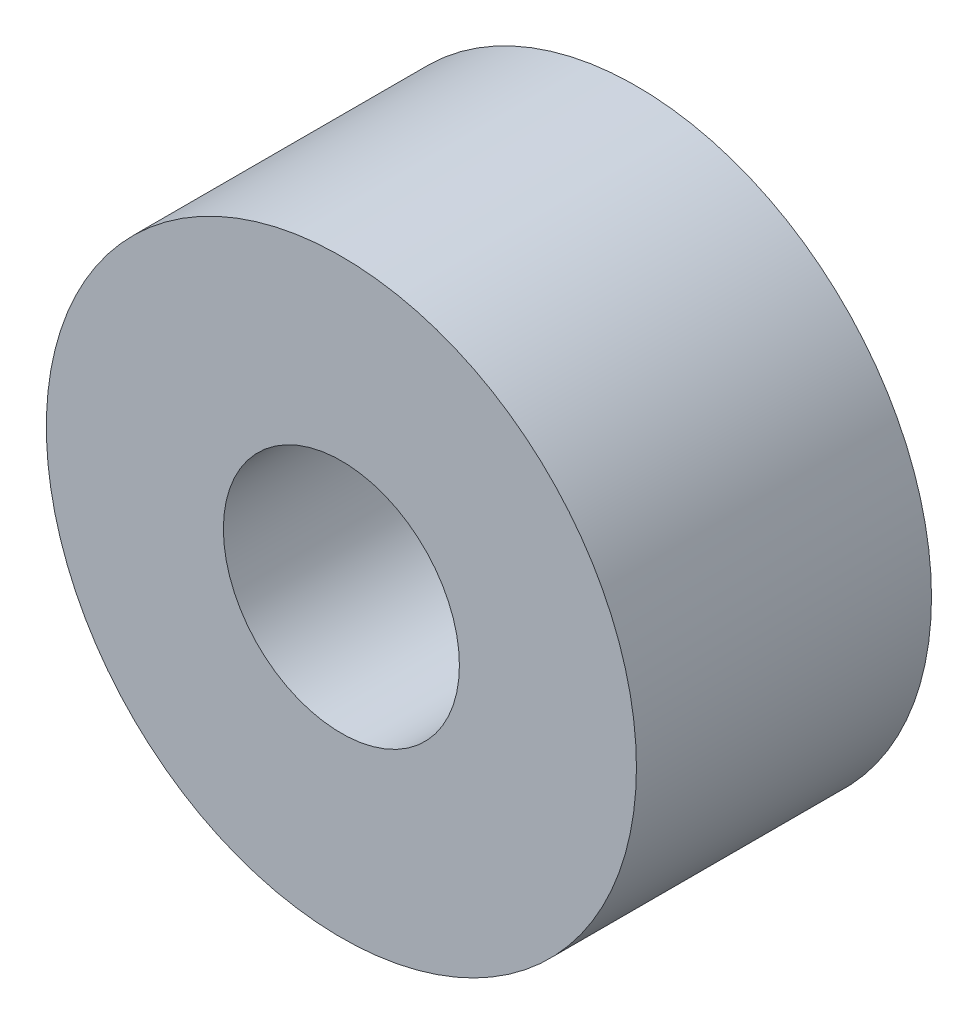
ISO-10303-21;
HEADER;
FILE_DESCRIPTION(('STEP AP214'),'2;1');
FILE_NAME('part.step','',(''),(''),'','','');
FILE_SCHEMA(('AUTOMOTIVE_DESIGN { 1 0 10303 214 1 1 1 1 }'));
ENDSEC;
DATA;
#1=APPLICATION_CONTEXT('core data for automotive mechanical design processes');
#2=APPLICATION_PROTOCOL_DEFINITION('international standard','automotive_design',2000,#1);
#3=PRODUCT_CONTEXT('',#1,'mechanical');
#4=PRODUCT('Part','Part','',(#3));
#5=PRODUCT_RELATED_PRODUCT_CATEGORY('part','',(#4));
#6=PRODUCT_DEFINITION_FORMATION('','',#4);
#7=PRODUCT_DEFINITION_CONTEXT('part definition',#1,'design');
#8=PRODUCT_DEFINITION('design','',#6,#7);
#9=PRODUCT_DEFINITION_SHAPE('','',#8);
#10=(LENGTH_UNIT() NAMED_UNIT(*) SI_UNIT(.MILLI.,.METRE.));
#11=(NAMED_UNIT(*) PLANE_ANGLE_UNIT() SI_UNIT($,.RADIAN.));
#12=(NAMED_UNIT(*) SI_UNIT($,.STERADIAN.) SOLID_ANGLE_UNIT());
#13=UNCERTAINTY_MEASURE_WITH_UNIT(LENGTH_MEASURE(1.E-05),#10,'distance_accuracy_value','');
#14=(GEOMETRIC_REPRESENTATION_CONTEXT(3) GLOBAL_UNCERTAINTY_ASSIGNED_CONTEXT((#13)) GLOBAL_UNIT_ASSIGNED_CONTEXT((#10,
#11,#12)) REPRESENTATION_CONTEXT('',''));
#15=CARTESIAN_POINT('',(0.,0.,0.));
#16=DIRECTION('',(0.,0.,1.));
#17=DIRECTION('',(1.,0.,0.));
#18=AXIS2_PLACEMENT_3D('',#15,#16,#17);
#19=CARTESIAN_POINT('',(35.9599999999989,18.866878763506,2.5));
#20=DIRECTION('',(0.,0.,-1.));
#21=DIRECTION('',(-1.,0.,0.));
#22=AXIS2_PLACEMENT_3D('',#19,#20,#21);
#23=CYLINDRICAL_SURFACE('',#22,2.5);
#24=CARTESIAN_POINT('',(35.9599999999989,18.866878763506,2.5));
#25=DIRECTION('',(0.,0.,1.));
#26=DIRECTION('',(1.,0.,0.));
#27=AXIS2_PLACEMENT_3D('',#24,#25,#26);
#28=CIRCLE('',#27,2.5);
#29=CARTESIAN_POINT('',(38.4599999999989,18.866878763506,2.5));
#30=VERTEX_POINT('',#29);
#31=EDGE_CURVE('E10',#30,#30,#28,.T.);
#32=ORIENTED_EDGE('',*,*,#31,.F.);
#33=EDGE_LOOP('',(#32));
#34=FACE_BOUND('',#33,.T.);
#35=CARTESIAN_POINT('',(35.9599999999989,18.866878763506,0.));
#36=DIRECTION('',(0.,0.,1.));
#37=DIRECTION('',(1.,0.,0.));
#38=AXIS2_PLACEMENT_3D('',#35,#36,#37);
#39=CIRCLE('',#38,2.5);
#40=CARTESIAN_POINT('',(38.4599999999989,18.866878763506,0.));
#41=VERTEX_POINT('',#40);
#42=EDGE_CURVE('E37',#41,#41,#39,.T.);
#43=ORIENTED_EDGE('',*,*,#42,.T.);
#44=EDGE_LOOP('',(#43));
#45=FACE_BOUND('',#44,.T.);
#46=ADVANCED_FACE('F30',(#34,#45),#23,.T.);
#47=CARTESIAN_POINT('',(35.9599999999989,18.866878763506,2.5));
#48=DIRECTION('',(0.,0.,1.));
#49=DIRECTION('',(1.,0.,0.));
#50=AXIS2_PLACEMENT_3D('',#47,#48,#49);
#51=PLANE('',#50);
#52=CARTESIAN_POINT('',(35.9599999999989,18.866878763506,2.5));
#53=DIRECTION('',(0.,0.,1.));
#54=DIRECTION('',(1.,0.,0.));
#55=AXIS2_PLACEMENT_3D('',#52,#53,#54);
#56=CIRCLE('',#55,0.999999999999998);
#57=CARTESIAN_POINT('',(36.9599999999989,18.866878763506,2.5));
#58=VERTEX_POINT('',#57);
#59=EDGE_CURVE('E43',#58,#58,#56,.T.);
#60=ORIENTED_EDGE('',*,*,#59,.F.);
#61=EDGE_LOOP('',(#60));
#62=FACE_BOUND('',#61,.T.);
#63=ORIENTED_EDGE('',*,*,#31,.T.);
#64=EDGE_LOOP('',(#63));
#65=FACE_BOUND('',#64,.T.);
#66=ADVANCED_FACE('F59',(#62,#65),#51,.T.);
#67=CARTESIAN_POINT('',(35.9599999999989,18.866878763506,0.));
#68=DIRECTION('',(0.,0.,1.));
#69=DIRECTION('',(1.,0.,0.));
#70=AXIS2_PLACEMENT_3D('',#67,#68,#69);
#71=PLANE('',#70);
#72=CARTESIAN_POINT('',(35.9599999999989,18.866878763506,0.));
#73=DIRECTION('',(0.,0.,1.));
#74=DIRECTION('',(1.,0.,0.));
#75=AXIS2_PLACEMENT_3D('',#72,#73,#74);
#76=CIRCLE('',#75,0.999999999999998);
#77=CARTESIAN_POINT('',(36.9599999999989,18.866878763506,0.));
#78=VERTEX_POINT('',#77);
#79=EDGE_CURVE('E33',#78,#78,#76,.T.);
#80=ORIENTED_EDGE('',*,*,#79,.T.);
#81=EDGE_LOOP('',(#80));
#82=FACE_BOUND('',#81,.T.);
#83=ORIENTED_EDGE('',*,*,#42,.F.);
#84=EDGE_LOOP('',(#83));
#85=FACE_BOUND('',#84,.T.);
#86=ADVANCED_FACE('F50',(#82,#85),#71,.F.);
#87=CARTESIAN_POINT('',(35.9599999999989,18.866878763506,-7.5));
#88=DIRECTION('',(0.,0.,1.));
#89=DIRECTION('',(1.,0.,0.));
#90=AXIS2_PLACEMENT_3D('',#87,#88,#89);
#91=CYLINDRICAL_SURFACE('',#90,0.999999999999998);
#92=ORIENTED_EDGE('',*,*,#59,.T.);
#93=EDGE_LOOP('',(#92));
#94=FACE_BOUND('',#93,.T.);
#95=ORIENTED_EDGE('',*,*,#79,.F.);
#96=EDGE_LOOP('',(#95));
#97=FACE_BOUND('',#96,.T.);
#98=ADVANCED_FACE('F53',(#94,#97),#91,.F.);
#99=CLOSED_SHELL('',(#46,#66,#86,#98));
#100=MANIFOLD_SOLID_BREP('B2',#99);
#101=ADVANCED_BREP_SHAPE_REPRESENTATION('',(#18,#100),#14);
#102=SHAPE_DEFINITION_REPRESENTATION(#9,#101);
ENDSEC;
END-ISO-10303-21;
